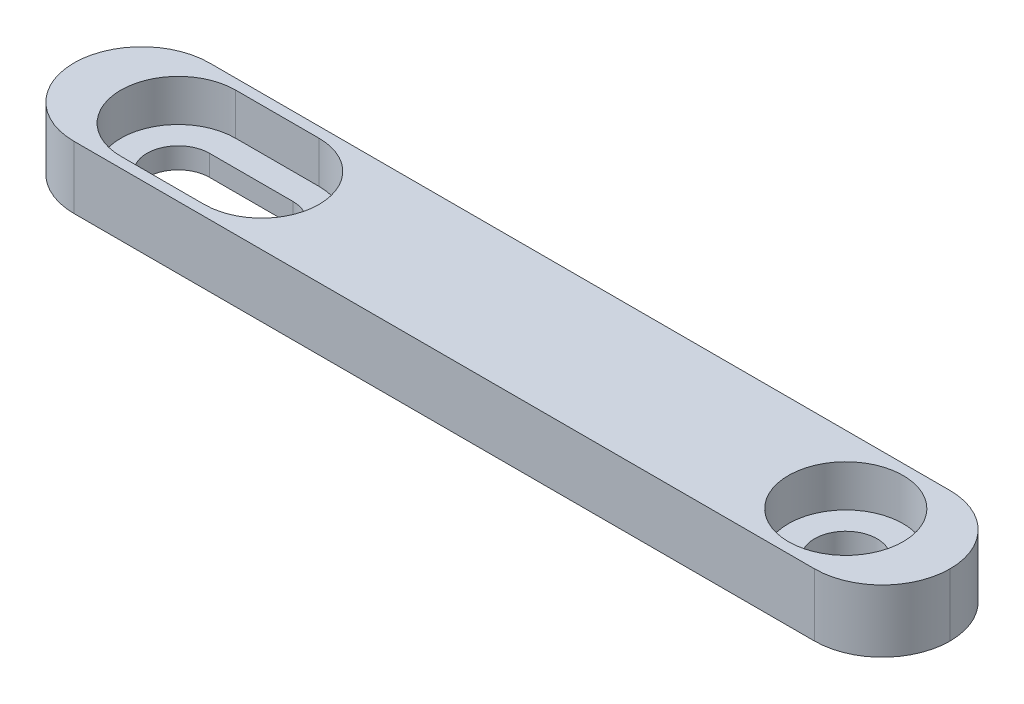
ISO-10303-21;
HEADER;
FILE_DESCRIPTION(('STEP AP214'),'2;1');
FILE_NAME('part.step','',(''),(''),'','','');
FILE_SCHEMA(('AUTOMOTIVE_DESIGN { 1 0 10303 214 1 1 1 1 }'));
ENDSEC;
DATA;
#1=APPLICATION_CONTEXT('core data for automotive mechanical design processes');
#2=APPLICATION_PROTOCOL_DEFINITION('international standard','automotive_design',2000,#1);
#3=PRODUCT_CONTEXT('',#1,'mechanical');
#4=PRODUCT('Part','Part','',(#3));
#5=PRODUCT_RELATED_PRODUCT_CATEGORY('part','',(#4));
#6=PRODUCT_DEFINITION_FORMATION('','',#4);
#7=PRODUCT_DEFINITION_CONTEXT('part definition',#1,'design');
#8=PRODUCT_DEFINITION('design','',#6,#7);
#9=PRODUCT_DEFINITION_SHAPE('','',#8);
#10=(LENGTH_UNIT() NAMED_UNIT(*) SI_UNIT(.MILLI.,.METRE.));
#11=(NAMED_UNIT(*) PLANE_ANGLE_UNIT() SI_UNIT($,.RADIAN.));
#12=(NAMED_UNIT(*) SI_UNIT($,.STERADIAN.) SOLID_ANGLE_UNIT());
#13=UNCERTAINTY_MEASURE_WITH_UNIT(LENGTH_MEASURE(1.E-05),#10,'distance_accuracy_value','');
#14=(GEOMETRIC_REPRESENTATION_CONTEXT(3) GLOBAL_UNCERTAINTY_ASSIGNED_CONTEXT((#13)) GLOBAL_UNIT_ASSIGNED_CONTEXT((#10,
#11,#12)) REPRESENTATION_CONTEXT('',''));
#15=CARTESIAN_POINT('',(0.,0.,0.));
#16=DIRECTION('',(0.,0.,1.));
#17=DIRECTION('',(1.,0.,0.));
#18=AXIS2_PLACEMENT_3D('',#15,#16,#17);
#19=CARTESIAN_POINT('',(16.,0.,0.));
#20=DIRECTION('',(0.,1.,0.));
#21=DIRECTION('',(0.,0.,1.));
#22=AXIS2_PLACEMENT_3D('',#19,#20,#21);
#23=CYLINDRICAL_SURFACE('',#22,1.5);
#24=CARTESIAN_POINT('',(16.,0.,0.));
#25=DIRECTION('',(0.,1.,0.));
#26=DIRECTION('',(0.,0.,1.));
#27=AXIS2_PLACEMENT_3D('',#24,#25,#26);
#28=CIRCLE('',#27,1.5);
#29=CARTESIAN_POINT('',(16.,0.,1.5));
#30=VERTEX_POINT('',#29);
#31=EDGE_CURVE('E193',#30,#30,#28,.T.);
#32=ORIENTED_EDGE('',*,*,#31,.F.);
#33=EDGE_LOOP('',(#32));
#34=FACE_BOUND('',#33,.T.);
#35=CARTESIAN_POINT('',(16.,1.,0.));
#36=DIRECTION('',(0.,1.,0.));
#37=DIRECTION('',(0.,0.,1.));
#38=AXIS2_PLACEMENT_3D('',#35,#36,#37);
#39=CIRCLE('',#38,1.5);
#40=CARTESIAN_POINT('',(16.,1.,1.5));
#41=VERTEX_POINT('',#40);
#42=EDGE_CURVE('E188',#41,#41,#39,.F.);
#43=ORIENTED_EDGE('',*,*,#42,.F.);
#44=EDGE_LOOP('',(#43));
#45=FACE_BOUND('',#44,.T.);
#46=ADVANCED_FACE('F32',(#34,#45),#23,.F.);
#47=CARTESIAN_POINT('',(-16.,0.,0.));
#48=DIRECTION('',(0.,1.,0.));
#49=DIRECTION('',(0.,0.,1.));
#50=AXIS2_PLACEMENT_3D('',#47,#48,#49);
#51=CYLINDRICAL_SURFACE('',#50,1.5);
#52=CARTESIAN_POINT('',(-16.,1.,0.));
#53=DIRECTION('',(0.,1.,0.));
#54=DIRECTION('',(0.,0.,1.));
#55=AXIS2_PLACEMENT_3D('',#52,#53,#54);
#56=CIRCLE('',#55,1.5);
#57=CARTESIAN_POINT('',(-16.,1.,1.5));
#58=VERTEX_POINT('',#57);
#59=CARTESIAN_POINT('',(-16.,1.,-1.5));
#60=VERTEX_POINT('',#59);
#61=EDGE_CURVE('E186',#58,#60,#56,.F.);
#62=ORIENTED_EDGE('',*,*,#61,.F.);
#63=DIRECTION('',(0.,1.,0.));
#64=VECTOR('',#63,1.);
#65=CARTESIAN_POINT('',(-16.,0.,1.5));
#66=LINE('',#65,#64);
#67=CARTESIAN_POINT('',(-16.,0.,1.5));
#68=VERTEX_POINT('',#67);
#69=EDGE_CURVE('E202',#68,#58,#66,.T.);
#70=ORIENTED_EDGE('',*,*,#69,.F.);
#71=CARTESIAN_POINT('',(-16.,0.,0.));
#72=DIRECTION('',(0.,1.,0.));
#73=DIRECTION('',(0.,0.,1.));
#74=AXIS2_PLACEMENT_3D('',#71,#72,#73);
#75=CIRCLE('',#74,1.5);
#76=CARTESIAN_POINT('',(-16.,0.,-1.5));
#77=VERTEX_POINT('',#76);
#78=EDGE_CURVE('E189',#77,#68,#75,.T.);
#79=ORIENTED_EDGE('',*,*,#78,.F.);
#80=DIRECTION('',(0.,1.,0.));
#81=VECTOR('',#80,1.);
#82=CARTESIAN_POINT('',(-16.,0.,-1.5));
#83=LINE('',#82,#81);
#84=EDGE_CURVE('E203',#77,#60,#83,.T.);
#85=ORIENTED_EDGE('',*,*,#84,.T.);
#86=EDGE_LOOP('',(#62,#70,#79,#85));
#87=FACE_BOUND('',#86,.T.);
#88=ADVANCED_FACE('F293',(#87),#51,.F.);
#89=CARTESIAN_POINT('',(-16.,0.,-1.5));
#90=DIRECTION('',(0.,0.,-1.));
#91=DIRECTION('',(-1.,0.,0.));
#92=AXIS2_PLACEMENT_3D('',#89,#90,#91);
#93=PLANE('',#92);
#94=DIRECTION('',(1.,0.,0.));
#95=VECTOR('',#94,1.);
#96=CARTESIAN_POINT('',(-16.,1.,-1.5));
#97=LINE('',#96,#95);
#98=CARTESIAN_POINT('',(-12.,1.,-1.5));
#99=VERTEX_POINT('',#98);
#100=EDGE_CURVE('E183',#60,#99,#97,.T.);
#101=ORIENTED_EDGE('',*,*,#100,.F.);
#102=ORIENTED_EDGE('',*,*,#84,.F.);
#103=DIRECTION('',(-1.,0.,0.));
#104=VECTOR('',#103,1.);
#105=CARTESIAN_POINT('',(-16.,0.,-1.5));
#106=LINE('',#105,#104);
#107=CARTESIAN_POINT('',(-12.,0.,-1.5));
#108=VERTEX_POINT('',#107);
#109=EDGE_CURVE('E199',#108,#77,#106,.T.);
#110=ORIENTED_EDGE('',*,*,#109,.F.);
#111=DIRECTION('',(0.,1.,0.));
#112=VECTOR('',#111,1.);
#113=CARTESIAN_POINT('',(-12.,0.,-1.5));
#114=LINE('',#113,#112);
#115=EDGE_CURVE('E207',#108,#99,#114,.T.);
#116=ORIENTED_EDGE('',*,*,#115,.T.);
#117=EDGE_LOOP('',(#101,#102,#110,#116));
#118=FACE_BOUND('',#117,.T.);
#119=ADVANCED_FACE('F298',(#118),#93,.F.);
#120=CARTESIAN_POINT('',(-12.,0.,0.));
#121=DIRECTION('',(0.,1.,0.));
#122=DIRECTION('',(0.,0.,1.));
#123=AXIS2_PLACEMENT_3D('',#120,#121,#122);
#124=CYLINDRICAL_SURFACE('',#123,1.5);
#125=CARTESIAN_POINT('',(-12.,1.,0.));
#126=DIRECTION('',(0.,1.,0.));
#127=DIRECTION('',(0.,0.,1.));
#128=AXIS2_PLACEMENT_3D('',#125,#126,#127);
#129=CIRCLE('',#128,1.5);
#130=CARTESIAN_POINT('',(-12.,1.,1.5));
#131=VERTEX_POINT('',#130);
#132=EDGE_CURVE('E181',#99,#131,#129,.F.);
#133=ORIENTED_EDGE('',*,*,#132,.F.);
#134=ORIENTED_EDGE('',*,*,#115,.F.);
#135=CARTESIAN_POINT('',(-12.,0.,0.));
#136=DIRECTION('',(0.,1.,0.));
#137=DIRECTION('',(0.,0.,1.));
#138=AXIS2_PLACEMENT_3D('',#135,#136,#137);
#139=CIRCLE('',#138,1.5);
#140=CARTESIAN_POINT('',(-12.,0.,1.5));
#141=VERTEX_POINT('',#140);
#142=EDGE_CURVE('E196',#141,#108,#139,.T.);
#143=ORIENTED_EDGE('',*,*,#142,.F.);
#144=DIRECTION('',(0.,1.,0.));
#145=VECTOR('',#144,1.);
#146=CARTESIAN_POINT('',(-12.,0.,1.5));
#147=LINE('',#146,#145);
#148=EDGE_CURVE('E210',#141,#131,#147,.T.);
#149=ORIENTED_EDGE('',*,*,#148,.T.);
#150=EDGE_LOOP('',(#133,#134,#143,#149));
#151=FACE_BOUND('',#150,.T.);
#152=ADVANCED_FACE('F307',(#151),#124,.F.);
#153=CARTESIAN_POINT('',(-16.,0.,1.5));
#154=DIRECTION('',(0.,0.,1.));
#155=DIRECTION('',(1.,0.,0.));
#156=AXIS2_PLACEMENT_3D('',#153,#154,#155);
#157=PLANE('',#156);
#158=DIRECTION('',(-1.,0.,0.));
#159=VECTOR('',#158,1.);
#160=CARTESIAN_POINT('',(-16.,1.,1.5));
#161=LINE('',#160,#159);
#162=EDGE_CURVE('E223',#131,#58,#161,.T.);
#163=ORIENTED_EDGE('',*,*,#162,.F.);
#164=ORIENTED_EDGE('',*,*,#148,.F.);
#165=DIRECTION('',(1.,0.,0.));
#166=VECTOR('',#165,1.);
#167=CARTESIAN_POINT('',(-16.,0.,1.5));
#168=LINE('',#167,#166);
#169=EDGE_CURVE('E192',#68,#141,#168,.T.);
#170=ORIENTED_EDGE('',*,*,#169,.F.);
#171=ORIENTED_EDGE('',*,*,#69,.T.);
#172=EDGE_LOOP('',(#163,#164,#170,#171));
#173=FACE_BOUND('',#172,.T.);
#174=ADVANCED_FACE('F304',(#173),#157,.F.);
#175=CARTESIAN_POINT('',(21.,3.,3.25));
#176=DIRECTION('',(0.,0.,-1.));
#177=DIRECTION('',(-1.,0.,0.));
#178=AXIS2_PLACEMENT_3D('',#175,#176,#177);
#179=PLANE('',#178);
#180=DIRECTION('',(1.,0.,0.));
#181=VECTOR('',#180,1.);
#182=CARTESIAN_POINT('',(21.,0.,3.25));
#183=LINE('',#182,#181);
#184=CARTESIAN_POINT('',(-17.75,0.,3.25));
#185=VERTEX_POINT('',#184);
#186=CARTESIAN_POINT('',(17.75,0.,3.25));
#187=VERTEX_POINT('',#186);
#188=EDGE_CURVE('E206',#185,#187,#183,.T.);
#189=ORIENTED_EDGE('',*,*,#188,.T.);
#190=DIRECTION('',(0.,-1.,0.));
#191=VECTOR('',#190,1.);
#192=CARTESIAN_POINT('',(17.75,3.,3.25));
#193=LINE('',#192,#191);
#194=CARTESIAN_POINT('',(17.75,3.,3.25));
#195=VERTEX_POINT('',#194);
#196=EDGE_CURVE('E241',#187,#195,#193,.F.);
#197=ORIENTED_EDGE('',*,*,#196,.T.);
#198=DIRECTION('',(1.,0.,0.));
#199=VECTOR('',#198,1.);
#200=CARTESIAN_POINT('',(21.,3.,3.25));
#201=LINE('',#200,#199);
#202=CARTESIAN_POINT('',(-17.75,3.,3.25));
#203=VERTEX_POINT('',#202);
#204=EDGE_CURVE('E217',#203,#195,#201,.T.);
#205=ORIENTED_EDGE('',*,*,#204,.F.);
#206=DIRECTION('',(0.,-1.,0.));
#207=VECTOR('',#206,1.);
#208=CARTESIAN_POINT('',(-17.75,3.,3.25));
#209=LINE('',#208,#207);
#210=EDGE_CURVE('E238',#203,#185,#209,.T.);
#211=ORIENTED_EDGE('',*,*,#210,.T.);
#212=EDGE_LOOP('',(#189,#197,#205,#211));
#213=FACE_BOUND('',#212,.T.);
#214=ADVANCED_FACE('F275',(#213),#179,.F.);
#215=CARTESIAN_POINT('',(21.,3.,-3.25));
#216=DIRECTION('',(0.,0.,1.));
#217=DIRECTION('',(1.,0.,0.));
#218=AXIS2_PLACEMENT_3D('',#215,#216,#217);
#219=PLANE('',#218);
#220=DIRECTION('',(-1.,0.,0.));
#221=VECTOR('',#220,1.);
#222=CARTESIAN_POINT('',(21.,3.,-3.25));
#223=LINE('',#222,#221);
#224=CARTESIAN_POINT('',(17.75,3.,-3.25));
#225=VERTEX_POINT('',#224);
#226=CARTESIAN_POINT('',(-17.75,3.,-3.25));
#227=VERTEX_POINT('',#226);
#228=EDGE_CURVE('E220',#225,#227,#223,.T.);
#229=ORIENTED_EDGE('',*,*,#228,.F.);
#230=DIRECTION('',(0.,-1.,0.));
#231=VECTOR('',#230,1.);
#232=CARTESIAN_POINT('',(17.75,3.,-3.25));
#233=LINE('',#232,#231);
#234=CARTESIAN_POINT('',(17.75,0.,-3.25));
#235=VERTEX_POINT('',#234);
#236=EDGE_CURVE('E11',#225,#235,#233,.T.);
#237=ORIENTED_EDGE('',*,*,#236,.T.);
#238=DIRECTION('',(-1.,0.,0.));
#239=VECTOR('',#238,1.);
#240=CARTESIAN_POINT('',(21.,0.,-3.25));
#241=LINE('',#240,#239);
#242=CARTESIAN_POINT('',(-17.75,0.,-3.25));
#243=VERTEX_POINT('',#242);
#244=EDGE_CURVE('E221',#235,#243,#241,.T.);
#245=ORIENTED_EDGE('',*,*,#244,.T.);
#246=DIRECTION('',(0.,-1.,0.));
#247=VECTOR('',#246,1.);
#248=CARTESIAN_POINT('',(-17.75,3.,-3.25));
#249=LINE('',#248,#247);
#250=EDGE_CURVE('E41',#243,#227,#249,.F.);
#251=ORIENTED_EDGE('',*,*,#250,.T.);
#252=EDGE_LOOP('',(#229,#237,#245,#251));
#253=FACE_BOUND('',#252,.T.);
#254=ADVANCED_FACE('F269',(#253),#219,.F.);
#255=CARTESIAN_POINT('',(0.,3.,0.));
#256=DIRECTION('',(0.,1.,0.));
#257=DIRECTION('',(0.,0.,1.));
#258=AXIS2_PLACEMENT_3D('',#255,#256,#257);
#259=PLANE('',#258);
#260=CARTESIAN_POINT('',(16.,3.,0.));
#261=DIRECTION('',(0.,1.,0.));
#262=DIRECTION('',(0.,0.,1.));
#263=AXIS2_PLACEMENT_3D('',#260,#261,#262);
#264=CIRCLE('',#263,2.75);
#265=CARTESIAN_POINT('',(16.,3.,2.75));
#266=VERTEX_POINT('',#265);
#267=EDGE_CURVE('E165',#266,#266,#264,.T.);
#268=ORIENTED_EDGE('',*,*,#267,.F.);
#269=EDGE_LOOP('',(#268));
#270=FACE_BOUND('',#269,.T.);
#271=CARTESIAN_POINT('',(-16.,3.,0.));
#272=DIRECTION('',(0.,1.,0.));
#273=DIRECTION('',(0.,0.,1.));
#274=AXIS2_PLACEMENT_3D('',#271,#272,#273);
#275=CIRCLE('',#274,2.75);
#276=CARTESIAN_POINT('',(-16.,3.,-2.75));
#277=VERTEX_POINT('',#276);
#278=CARTESIAN_POINT('',(-16.,3.,2.75));
#279=VERTEX_POINT('',#278);
#280=EDGE_CURVE('E141',#277,#279,#275,.T.);
#281=ORIENTED_EDGE('',*,*,#280,.F.);
#282=DIRECTION('',(-1.,0.,0.));
#283=VECTOR('',#282,1.);
#284=CARTESIAN_POINT('',(-16.,3.,-2.75));
#285=LINE('',#284,#283);
#286=CARTESIAN_POINT('',(-12.,3.,-2.75));
#287=VERTEX_POINT('',#286);
#288=EDGE_CURVE('E159',#287,#277,#285,.T.);
#289=ORIENTED_EDGE('',*,*,#288,.F.);
#290=CARTESIAN_POINT('',(-12.,3.,0.));
#291=DIRECTION('',(0.,1.,0.));
#292=DIRECTION('',(0.,0.,1.));
#293=AXIS2_PLACEMENT_3D('',#290,#291,#292);
#294=CIRCLE('',#293,2.75);
#295=CARTESIAN_POINT('',(-12.,3.,2.75));
#296=VERTEX_POINT('',#295);
#297=EDGE_CURVE('E162',#296,#287,#294,.T.);
#298=ORIENTED_EDGE('',*,*,#297,.F.);
#299=DIRECTION('',(1.,0.,0.));
#300=VECTOR('',#299,1.);
#301=CARTESIAN_POINT('',(-16.,3.,2.75));
#302=LINE('',#301,#300);
#303=EDGE_CURVE('E171',#279,#296,#302,.T.);
#304=ORIENTED_EDGE('',*,*,#303,.F.);
#305=EDGE_LOOP('',(#281,#289,#298,#304));
#306=FACE_BOUND('',#305,.T.);
#307=ORIENTED_EDGE('',*,*,#204,.T.);
#308=CARTESIAN_POINT('',(17.75,3.,0.));
#309=DIRECTION('',(0.,1.,0.));
#310=DIRECTION('',(0.,0.,1.));
#311=AXIS2_PLACEMENT_3D('',#308,#309,#310);
#312=CIRCLE('',#311,3.25);
#313=CARTESIAN_POINT('',(21.,3.,0.));
#314=VERTEX_POINT('',#313);
#315=EDGE_CURVE('E249',#195,#314,#312,.T.);
#316=ORIENTED_EDGE('',*,*,#315,.T.);
#317=CARTESIAN_POINT('',(17.75,3.,0.));
#318=DIRECTION('',(0.,1.,0.));
#319=DIRECTION('',(0.,0.,1.));
#320=AXIS2_PLACEMENT_3D('',#317,#318,#319);
#321=CIRCLE('',#320,3.25);
#322=EDGE_CURVE('E55',#314,#225,#321,.T.);
#323=ORIENTED_EDGE('',*,*,#322,.T.);
#324=ORIENTED_EDGE('',*,*,#228,.T.);
#325=CARTESIAN_POINT('',(-17.75,3.,0.));
#326=DIRECTION('',(0.,1.,0.));
#327=DIRECTION('',(0.,0.,1.));
#328=AXIS2_PLACEMENT_3D('',#325,#326,#327);
#329=CIRCLE('',#328,3.25);
#330=CARTESIAN_POINT('',(-21.,3.,0.));
#331=VERTEX_POINT('',#330);
#332=EDGE_CURVE('E244',#227,#331,#329,.T.);
#333=ORIENTED_EDGE('',*,*,#332,.T.);
#334=CARTESIAN_POINT('',(-17.75,3.,0.));
#335=DIRECTION('',(0.,1.,0.));
#336=DIRECTION('',(0.,0.,1.));
#337=AXIS2_PLACEMENT_3D('',#334,#335,#336);
#338=CIRCLE('',#337,3.25);
#339=EDGE_CURVE('E246',#331,#203,#338,.T.);
#340=ORIENTED_EDGE('',*,*,#339,.T.);
#341=EDGE_LOOP('',(#307,#316,#323,#324,#333,#340));
#342=FACE_BOUND('',#341,.T.);
#343=ADVANCED_FACE('F278',(#270,#306,#342),#259,.T.);
#344=CARTESIAN_POINT('',(0.,0.,0.));
#345=DIRECTION('',(0.,1.,0.));
#346=DIRECTION('',(0.,0.,1.));
#347=AXIS2_PLACEMENT_3D('',#344,#345,#346);
#348=PLANE('',#347);
#349=ORIENTED_EDGE('',*,*,#109,.T.);
#350=ORIENTED_EDGE('',*,*,#78,.T.);
#351=ORIENTED_EDGE('',*,*,#169,.T.);
#352=ORIENTED_EDGE('',*,*,#142,.T.);
#353=EDGE_LOOP('',(#349,#350,#351,#352));
#354=FACE_BOUND('',#353,.T.);
#355=ORIENTED_EDGE('',*,*,#31,.T.);
#356=EDGE_LOOP('',(#355));
#357=FACE_BOUND('',#356,.T.);
#358=CARTESIAN_POINT('',(17.75,0.,0.));
#359=DIRECTION('',(0.,1.,0.));
#360=DIRECTION('',(0.,0.,1.));
#361=AXIS2_PLACEMENT_3D('',#358,#359,#360);
#362=CIRCLE('',#361,3.25);
#363=CARTESIAN_POINT('',(21.,0.,0.));
#364=VERTEX_POINT('',#363);
#365=EDGE_CURVE('E234',#235,#364,#362,.F.);
#366=ORIENTED_EDGE('',*,*,#365,.T.);
#367=CARTESIAN_POINT('',(17.75,0.,0.));
#368=DIRECTION('',(0.,1.,0.));
#369=DIRECTION('',(0.,0.,1.));
#370=AXIS2_PLACEMENT_3D('',#367,#368,#369);
#371=CIRCLE('',#370,3.25);
#372=EDGE_CURVE('E236',#364,#187,#371,.F.);
#373=ORIENTED_EDGE('',*,*,#372,.T.);
#374=ORIENTED_EDGE('',*,*,#188,.F.);
#375=CARTESIAN_POINT('',(-17.75,0.,0.));
#376=DIRECTION('',(0.,1.,0.));
#377=DIRECTION('',(0.,0.,1.));
#378=AXIS2_PLACEMENT_3D('',#375,#376,#377);
#379=CIRCLE('',#378,3.25);
#380=CARTESIAN_POINT('',(-21.,0.,0.));
#381=VERTEX_POINT('',#380);
#382=EDGE_CURVE('E232',#185,#381,#379,.F.);
#383=ORIENTED_EDGE('',*,*,#382,.T.);
#384=CARTESIAN_POINT('',(-17.75,0.,0.));
#385=DIRECTION('',(0.,1.,0.));
#386=DIRECTION('',(0.,0.,1.));
#387=AXIS2_PLACEMENT_3D('',#384,#385,#386);
#388=CIRCLE('',#387,3.25);
#389=EDGE_CURVE('E228',#381,#243,#388,.F.);
#390=ORIENTED_EDGE('',*,*,#389,.T.);
#391=ORIENTED_EDGE('',*,*,#244,.F.);
#392=EDGE_LOOP('',(#366,#373,#374,#383,#390,#391));
#393=FACE_BOUND('',#392,.T.);
#394=ADVANCED_FACE('F266',(#354,#357,#393),#348,.F.);
#395=CARTESIAN_POINT('',(-16.,1.,0.));
#396=DIRECTION('',(0.,1.,0.));
#397=DIRECTION('',(0.,0.,1.));
#398=AXIS2_PLACEMENT_3D('',#395,#396,#397);
#399=PLANE('',#398);
#400=CARTESIAN_POINT('',(-16.,1.,0.));
#401=DIRECTION('',(0.,1.,0.));
#402=DIRECTION('',(0.,0.,1.));
#403=AXIS2_PLACEMENT_3D('',#400,#401,#402);
#404=CIRCLE('',#403,2.75);
#405=CARTESIAN_POINT('',(-16.,1.,-2.75));
#406=VERTEX_POINT('',#405);
#407=CARTESIAN_POINT('',(-16.,1.,2.75));
#408=VERTEX_POINT('',#407);
#409=EDGE_CURVE('E138',#406,#408,#404,.T.);
#410=ORIENTED_EDGE('',*,*,#409,.T.);
#411=DIRECTION('',(1.,0.,0.));
#412=VECTOR('',#411,1.);
#413=CARTESIAN_POINT('',(-16.,1.,2.75));
#414=LINE('',#413,#412);
#415=CARTESIAN_POINT('',(-12.,1.,2.75));
#416=VERTEX_POINT('',#415);
#417=EDGE_CURVE('E149',#408,#416,#414,.T.);
#418=ORIENTED_EDGE('',*,*,#417,.T.);
#419=CARTESIAN_POINT('',(-12.,1.,0.));
#420=DIRECTION('',(0.,1.,0.));
#421=DIRECTION('',(0.,0.,1.));
#422=AXIS2_PLACEMENT_3D('',#419,#420,#421);
#423=CIRCLE('',#422,2.75);
#424=CARTESIAN_POINT('',(-12.,1.,-2.75));
#425=VERTEX_POINT('',#424);
#426=EDGE_CURVE('E154',#416,#425,#423,.T.);
#427=ORIENTED_EDGE('',*,*,#426,.T.);
#428=DIRECTION('',(-1.,0.,0.));
#429=VECTOR('',#428,1.);
#430=CARTESIAN_POINT('',(-16.,1.,-2.75));
#431=LINE('',#430,#429);
#432=EDGE_CURVE('E146',#425,#406,#431,.T.);
#433=ORIENTED_EDGE('',*,*,#432,.T.);
#434=EDGE_LOOP('',(#410,#418,#427,#433));
#435=FACE_BOUND('',#434,.T.);
#436=ORIENTED_EDGE('',*,*,#61,.T.);
#437=ORIENTED_EDGE('',*,*,#100,.T.);
#438=ORIENTED_EDGE('',*,*,#132,.T.);
#439=ORIENTED_EDGE('',*,*,#162,.T.);
#440=EDGE_LOOP('',(#436,#437,#438,#439));
#441=FACE_BOUND('',#440,.T.);
#442=ADVANCED_FACE('F156',(#435,#441),#399,.T.);
#443=CARTESIAN_POINT('',(-16.,1.,0.));
#444=DIRECTION('',(0.,1.,0.));
#445=DIRECTION('',(0.,0.,1.));
#446=AXIS2_PLACEMENT_3D('',#443,#444,#445);
#447=CYLINDRICAL_SURFACE('',#446,2.75);
#448=ORIENTED_EDGE('',*,*,#280,.T.);
#449=DIRECTION('',(0.,1.,0.));
#450=VECTOR('',#449,1.);
#451=CARTESIAN_POINT('',(-16.,1.,2.75));
#452=LINE('',#451,#450);
#453=EDGE_CURVE('E134',#408,#279,#452,.T.);
#454=ORIENTED_EDGE('',*,*,#453,.F.);
#455=ORIENTED_EDGE('',*,*,#409,.F.);
#456=DIRECTION('',(0.,1.,0.));
#457=VECTOR('',#456,1.);
#458=CARTESIAN_POINT('',(-16.,1.,-2.75));
#459=LINE('',#458,#457);
#460=EDGE_CURVE('E176',#406,#277,#459,.T.);
#461=ORIENTED_EDGE('',*,*,#460,.T.);
#462=EDGE_LOOP('',(#448,#454,#455,#461));
#463=FACE_BOUND('',#462,.T.);
#464=ADVANCED_FACE('F136',(#463),#447,.F.);
#465=CARTESIAN_POINT('',(-16.,1.,-2.75));
#466=DIRECTION('',(0.,0.,-1.));
#467=DIRECTION('',(-1.,0.,0.));
#468=AXIS2_PLACEMENT_3D('',#465,#466,#467);
#469=PLANE('',#468);
#470=ORIENTED_EDGE('',*,*,#288,.T.);
#471=ORIENTED_EDGE('',*,*,#460,.F.);
#472=ORIENTED_EDGE('',*,*,#432,.F.);
#473=DIRECTION('',(0.,1.,0.));
#474=VECTOR('',#473,1.);
#475=CARTESIAN_POINT('',(-12.,1.,-2.75));
#476=LINE('',#475,#474);
#477=EDGE_CURVE('E178',#425,#287,#476,.T.);
#478=ORIENTED_EDGE('',*,*,#477,.T.);
#479=EDGE_LOOP('',(#470,#471,#472,#478));
#480=FACE_BOUND('',#479,.T.);
#481=ADVANCED_FACE('F317',(#480),#469,.F.);
#482=CARTESIAN_POINT('',(-12.,1.,0.));
#483=DIRECTION('',(0.,1.,0.));
#484=DIRECTION('',(0.,0.,1.));
#485=AXIS2_PLACEMENT_3D('',#482,#483,#484);
#486=CYLINDRICAL_SURFACE('',#485,2.75);
#487=ORIENTED_EDGE('',*,*,#297,.T.);
#488=ORIENTED_EDGE('',*,*,#477,.F.);
#489=ORIENTED_EDGE('',*,*,#426,.F.);
#490=DIRECTION('',(0.,1.,0.));
#491=VECTOR('',#490,1.);
#492=CARTESIAN_POINT('',(-12.,1.,2.75));
#493=LINE('',#492,#491);
#494=EDGE_CURVE('E145',#416,#296,#493,.T.);
#495=ORIENTED_EDGE('',*,*,#494,.T.);
#496=EDGE_LOOP('',(#487,#488,#489,#495));
#497=FACE_BOUND('',#496,.T.);
#498=ADVANCED_FACE('F321',(#497),#486,.F.);
#499=CARTESIAN_POINT('',(-16.,1.,2.75));
#500=DIRECTION('',(0.,0.,1.));
#501=DIRECTION('',(1.,0.,0.));
#502=AXIS2_PLACEMENT_3D('',#499,#500,#501);
#503=PLANE('',#502);
#504=ORIENTED_EDGE('',*,*,#303,.T.);
#505=ORIENTED_EDGE('',*,*,#494,.F.);
#506=ORIENTED_EDGE('',*,*,#417,.F.);
#507=ORIENTED_EDGE('',*,*,#453,.T.);
#508=EDGE_LOOP('',(#504,#505,#506,#507));
#509=FACE_BOUND('',#508,.T.);
#510=ADVANCED_FACE('F150',(#509),#503,.F.);
#511=CARTESIAN_POINT('',(16.,1.,0.));
#512=DIRECTION('',(0.,1.,0.));
#513=DIRECTION('',(0.,0.,1.));
#514=AXIS2_PLACEMENT_3D('',#511,#512,#513);
#515=PLANE('',#514);
#516=CARTESIAN_POINT('',(16.,1.,0.));
#517=DIRECTION('',(0.,1.,0.));
#518=DIRECTION('',(0.,0.,1.));
#519=AXIS2_PLACEMENT_3D('',#516,#517,#518);
#520=CIRCLE('',#519,2.75);
#521=CARTESIAN_POINT('',(16.,1.,2.75));
#522=VERTEX_POINT('',#521);
#523=EDGE_CURVE('E184',#522,#522,#520,.T.);
#524=ORIENTED_EDGE('',*,*,#523,.T.);
#525=EDGE_LOOP('',(#524));
#526=FACE_BOUND('',#525,.T.);
#527=ORIENTED_EDGE('',*,*,#42,.T.);
#528=EDGE_LOOP('',(#527));
#529=FACE_BOUND('',#528,.T.);
#530=ADVANCED_FACE('F320',(#526,#529),#515,.T.);
#531=CARTESIAN_POINT('',(16.,1.,0.));
#532=DIRECTION('',(0.,1.,0.));
#533=DIRECTION('',(0.,0.,1.));
#534=AXIS2_PLACEMENT_3D('',#531,#532,#533);
#535=CYLINDRICAL_SURFACE('',#534,2.75);
#536=ORIENTED_EDGE('',*,*,#523,.F.);
#537=EDGE_LOOP('',(#536));
#538=FACE_BOUND('',#537,.T.);
#539=ORIENTED_EDGE('',*,*,#267,.T.);
#540=EDGE_LOOP('',(#539));
#541=FACE_BOUND('',#540,.T.);
#542=ADVANCED_FACE('F330',(#538,#541),#535,.F.);
#543=CARTESIAN_POINT('',(17.75,3.,0.));
#544=DIRECTION('',(0.,-1.,0.));
#545=DIRECTION('',(0.,0.,-1.));
#546=AXIS2_PLACEMENT_3D('',#543,#544,#545);
#547=CYLINDRICAL_SURFACE('',#546,3.25);
#548=ORIENTED_EDGE('',*,*,#236,.F.);
#549=ORIENTED_EDGE('',*,*,#322,.F.);
#550=DIRECTION('',(0.,-1.,0.));
#551=VECTOR('',#550,1.);
#552=CARTESIAN_POINT('',(21.,3.,0.));
#553=LINE('',#552,#551);
#554=EDGE_CURVE('E172',#364,#314,#553,.F.);
#555=ORIENTED_EDGE('',*,*,#554,.F.);
#556=ORIENTED_EDGE('',*,*,#365,.F.);
#557=EDGE_LOOP('',(#548,#549,#555,#556));
#558=FACE_BOUND('',#557,.T.);
#559=ADVANCED_FACE('F272',(#558),#547,.T.);
#560=CARTESIAN_POINT('',(17.75,3.,0.));
#561=DIRECTION('',(0.,-1.,0.));
#562=DIRECTION('',(0.,0.,-1.));
#563=AXIS2_PLACEMENT_3D('',#560,#561,#562);
#564=CYLINDRICAL_SURFACE('',#563,3.25);
#565=ORIENTED_EDGE('',*,*,#315,.F.);
#566=ORIENTED_EDGE('',*,*,#196,.F.);
#567=ORIENTED_EDGE('',*,*,#372,.F.);
#568=ORIENTED_EDGE('',*,*,#554,.T.);
#569=EDGE_LOOP('',(#565,#566,#567,#568));
#570=FACE_BOUND('',#569,.T.);
#571=ADVANCED_FACE('F277',(#570),#564,.T.);
#572=CARTESIAN_POINT('',(-17.75,3.,0.));
#573=DIRECTION('',(0.,-1.,0.));
#574=DIRECTION('',(0.,0.,-1.));
#575=AXIS2_PLACEMENT_3D('',#572,#573,#574);
#576=CYLINDRICAL_SURFACE('',#575,3.25);
#577=DIRECTION('',(0.,-1.,0.));
#578=VECTOR('',#577,1.);
#579=CARTESIAN_POINT('',(-21.,3.,0.));
#580=LINE('',#579,#578);
#581=EDGE_CURVE('E36',#331,#381,#580,.T.);
#582=ORIENTED_EDGE('',*,*,#581,.F.);
#583=ORIENTED_EDGE('',*,*,#332,.F.);
#584=ORIENTED_EDGE('',*,*,#250,.F.);
#585=ORIENTED_EDGE('',*,*,#389,.F.);
#586=EDGE_LOOP('',(#582,#583,#584,#585));
#587=FACE_BOUND('',#586,.T.);
#588=ADVANCED_FACE('F34',(#587),#576,.T.);
#589=CARTESIAN_POINT('',(-17.75,3.,0.));
#590=DIRECTION('',(0.,-1.,0.));
#591=DIRECTION('',(0.,0.,-1.));
#592=AXIS2_PLACEMENT_3D('',#589,#590,#591);
#593=CYLINDRICAL_SURFACE('',#592,3.25);
#594=ORIENTED_EDGE('',*,*,#339,.F.);
#595=ORIENTED_EDGE('',*,*,#581,.T.);
#596=ORIENTED_EDGE('',*,*,#382,.F.);
#597=ORIENTED_EDGE('',*,*,#210,.F.);
#598=EDGE_LOOP('',(#594,#595,#596,#597));
#599=FACE_BOUND('',#598,.T.);
#600=ADVANCED_FACE('F259',(#599),#593,.T.);
#601=CLOSED_SHELL('',(#46,#88,#119,#152,#174,#214,#254,#343,#394,#442,#464,#481,#498,#510,#530,
#542,#559,#571,#588,#600));
#602=MANIFOLD_SOLID_BREP('B2',#601);
#603=ADVANCED_BREP_SHAPE_REPRESENTATION('',(#18,#602),#14);
#604=SHAPE_DEFINITION_REPRESENTATION(#9,#603);
ENDSEC;
END-ISO-10303-21;
